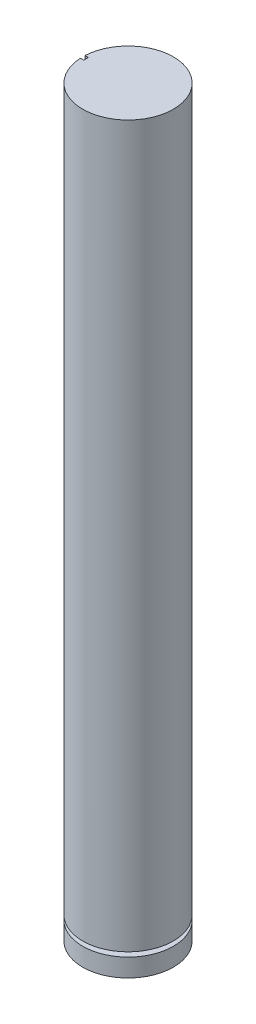
ISO-10303-21;
HEADER;
FILE_DESCRIPTION(('STEP AP214'),'2;1');
FILE_NAME('part.step','',(''),(''),'','','');
FILE_SCHEMA(('AUTOMOTIVE_DESIGN { 1 0 10303 214 1 1 1 1 }'));
ENDSEC;
DATA;
#1=APPLICATION_CONTEXT('core data for automotive mechanical design processes');
#2=APPLICATION_PROTOCOL_DEFINITION('international standard','automotive_design',2000,#1);
#3=PRODUCT_CONTEXT('',#1,'mechanical');
#4=PRODUCT('Part','Part','',(#3));
#5=PRODUCT_RELATED_PRODUCT_CATEGORY('part','',(#4));
#6=PRODUCT_DEFINITION_FORMATION('','',#4);
#7=PRODUCT_DEFINITION_CONTEXT('part definition',#1,'design');
#8=PRODUCT_DEFINITION('design','',#6,#7);
#9=PRODUCT_DEFINITION_SHAPE('','',#8);
#10=(LENGTH_UNIT() NAMED_UNIT(*) SI_UNIT(.MILLI.,.METRE.));
#11=(NAMED_UNIT(*) PLANE_ANGLE_UNIT() SI_UNIT($,.RADIAN.));
#12=(NAMED_UNIT(*) SI_UNIT($,.STERADIAN.) SOLID_ANGLE_UNIT());
#13=UNCERTAINTY_MEASURE_WITH_UNIT(LENGTH_MEASURE(1.E-05),#10,'distance_accuracy_value','');
#14=(GEOMETRIC_REPRESENTATION_CONTEXT(3) GLOBAL_UNCERTAINTY_ASSIGNED_CONTEXT((#13)) GLOBAL_UNIT_ASSIGNED_CONTEXT((#10,
#11,#12)) REPRESENTATION_CONTEXT('',''));
#15=CARTESIAN_POINT('',(0.,0.,0.));
#16=DIRECTION('',(0.,0.,1.));
#17=DIRECTION('',(1.,0.,0.));
#18=AXIS2_PLACEMENT_3D('',#15,#16,#17);
#19=CARTESIAN_POINT('',(0.,32.766,0.));
#20=DIRECTION('',(0.,-1.,0.));
#21=DIRECTION('',(0.,0.,-1.));
#22=AXIS2_PLACEMENT_3D('',#19,#20,#21);
#23=CYLINDRICAL_SURFACE('',#22,2.);
#24=CARTESIAN_POINT('',(0.,0.800000000000001,0.));
#25=DIRECTION('',(0.,-1.,0.));
#26=DIRECTION('',(0.,0.,-1.));
#27=AXIS2_PLACEMENT_3D('',#24,#25,#26);
#28=CIRCLE('',#27,2.);
#29=CARTESIAN_POINT('',(0.,0.800000000000001,-2.));
#30=VERTEX_POINT('',#29);
#31=EDGE_CURVE('E131',#30,#30,#28,.T.);
#32=ORIENTED_EDGE('',*,*,#31,.T.);
#33=EDGE_LOOP('',(#32));
#34=FACE_BOUND('',#33,.T.);
#35=CARTESIAN_POINT('',(0.,0.,0.));
#36=DIRECTION('',(0.,1.,0.));
#37=DIRECTION('',(0.,0.,1.));
#38=AXIS2_PLACEMENT_3D('',#35,#36,#37);
#39=CIRCLE('',#38,2.);
#40=CARTESIAN_POINT('',(0.,0.,2.));
#41=VERTEX_POINT('',#40);
#42=EDGE_CURVE('E135',#41,#41,#39,.T.);
#43=ORIENTED_EDGE('',*,*,#42,.T.);
#44=EDGE_LOOP('',(#43));
#45=FACE_BOUND('',#44,.T.);
#46=ADVANCED_FACE('F43',(#34,#45),#23,.T.);
#47=CARTESIAN_POINT('',(0.,0.,0.));
#48=DIRECTION('',(0.,1.,0.));
#49=DIRECTION('',(0.,0.,1.));
#50=AXIS2_PLACEMENT_3D('',#47,#48,#49);
#51=PLANE('',#50);
#52=ORIENTED_EDGE('',*,*,#42,.F.);
#53=EDGE_LOOP('',(#52));
#54=FACE_BOUND('',#53,.T.);
#55=ADVANCED_FACE('F162',(#54),#51,.F.);
#56=CARTESIAN_POINT('',(0.,0.800000000000001,-2.));
#57=DIRECTION('',(0.,-1.,0.));
#58=DIRECTION('',(0.,0.,-1.));
#59=AXIS2_PLACEMENT_3D('',#56,#57,#58);
#60=PLANE('',#59);
#61=ORIENTED_EDGE('',*,*,#31,.F.);
#62=EDGE_LOOP('',(#61));
#63=FACE_BOUND('',#62,.T.);
#64=CARTESIAN_POINT('',(0.,0.8,0.));
#65=DIRECTION('',(0.,-1.,0.));
#66=DIRECTION('',(0.,0.,-1.));
#67=AXIS2_PLACEMENT_3D('',#64,#65,#66);
#68=CIRCLE('',#67,1.5);
#69=CARTESIAN_POINT('',(0.,0.8,-1.5));
#70=VERTEX_POINT('',#69);
#71=EDGE_CURVE('E127',#70,#70,#68,.T.);
#72=ORIENTED_EDGE('',*,*,#71,.T.);
#73=EDGE_LOOP('',(#72));
#74=FACE_BOUND('',#73,.T.);
#75=ADVANCED_FACE('F167',(#63,#74),#60,.F.);
#76=CARTESIAN_POINT('',(0.,0.,0.));
#77=DIRECTION('',(0.,-1.,0.));
#78=DIRECTION('',(0.,0.,-1.));
#79=AXIS2_PLACEMENT_3D('',#76,#77,#78);
#80=CYLINDRICAL_SURFACE('',#79,1.5);
#81=ORIENTED_EDGE('',*,*,#71,.F.);
#82=EDGE_LOOP('',(#81));
#83=FACE_BOUND('',#82,.T.);
#84=CARTESIAN_POINT('',(0.,1.,0.));
#85=DIRECTION('',(0.,-1.,0.));
#86=DIRECTION('',(0.,0.,-1.));
#87=AXIS2_PLACEMENT_3D('',#84,#85,#86);
#88=CIRCLE('',#87,1.5);
#89=CARTESIAN_POINT('',(0.,1.,-1.5));
#90=VERTEX_POINT('',#89);
#91=EDGE_CURVE('E123',#90,#90,#88,.T.);
#92=ORIENTED_EDGE('',*,*,#91,.T.);
#93=EDGE_LOOP('',(#92));
#94=FACE_BOUND('',#93,.T.);
#95=ADVANCED_FACE('F175',(#83,#94),#80,.T.);
#96=CARTESIAN_POINT('',(0.,1.,-2.));
#97=DIRECTION('',(0.,1.,0.));
#98=DIRECTION('',(0.,0.,1.));
#99=AXIS2_PLACEMENT_3D('',#96,#97,#98);
#100=PLANE('',#99);
#101=ORIENTED_EDGE('',*,*,#91,.F.);
#102=EDGE_LOOP('',(#101));
#103=FACE_BOUND('',#102,.T.);
#104=CARTESIAN_POINT('',(0.,1.,0.));
#105=DIRECTION('',(0.,-1.,0.));
#106=DIRECTION('',(0.,0.,-1.));
#107=AXIS2_PLACEMENT_3D('',#104,#105,#106);
#108=CIRCLE('',#107,2.);
#109=CARTESIAN_POINT('',(0.,1.,-2.));
#110=VERTEX_POINT('',#109);
#111=EDGE_CURVE('E118',#110,#110,#108,.T.);
#112=ORIENTED_EDGE('',*,*,#111,.T.);
#113=EDGE_LOOP('',(#112));
#114=FACE_BOUND('',#113,.T.);
#115=ADVANCED_FACE('F181',(#103,#114),#100,.F.);
#116=CARTESIAN_POINT('',(0.,32.766,0.));
#117=DIRECTION('',(0.,1.,0.));
#118=DIRECTION('',(0.,0.,1.));
#119=AXIS2_PLACEMENT_3D('',#116,#117,#118);
#120=PLANE('',#119);
#121=DIRECTION('',(-1.,0.,0.));
#122=VECTOR('',#121,1.);
#123=CARTESIAN_POINT('',(-2.,32.766,-0.0999999999999998));
#124=LINE('',#123,#122);
#125=CARTESIAN_POINT('',(-1.85,32.766,-0.0999999999999998));
#126=VERTEX_POINT('',#125);
#127=CARTESIAN_POINT('',(-1.99749843554382,32.766,-0.0999999999999998));
#128=VERTEX_POINT('',#127);
#129=EDGE_CURVE('E90',#126,#128,#124,.T.);
#130=ORIENTED_EDGE('',*,*,#129,.F.);
#131=DIRECTION('',(0.,0.,-1.));
#132=VECTOR('',#131,1.);
#133=CARTESIAN_POINT('',(-1.85,32.766,-0.0999999999999998));
#134=LINE('',#133,#132);
#135=CARTESIAN_POINT('',(-1.85,32.766,0.1));
#136=VERTEX_POINT('',#135);
#137=EDGE_CURVE('E112',#136,#126,#134,.T.);
#138=ORIENTED_EDGE('',*,*,#137,.F.);
#139=DIRECTION('',(1.,0.,0.));
#140=VECTOR('',#139,1.);
#141=CARTESIAN_POINT('',(-2.,32.766,0.1));
#142=LINE('',#141,#140);
#143=CARTESIAN_POINT('',(-1.99749843554382,32.766,0.1));
#144=VERTEX_POINT('',#143);
#145=EDGE_CURVE('E96',#144,#136,#142,.T.);
#146=ORIENTED_EDGE('',*,*,#145,.F.);
#147=CARTESIAN_POINT('',(0.,32.766,0.));
#148=DIRECTION('',(0.,1.,0.));
#149=DIRECTION('',(0.,0.,1.));
#150=AXIS2_PLACEMENT_3D('',#147,#148,#149);
#151=CIRCLE('',#150,2.);
#152=EDGE_CURVE('E136',#144,#128,#151,.T.);
#153=ORIENTED_EDGE('',*,*,#152,.T.);
#154=EDGE_LOOP('',(#130,#138,#146,#153));
#155=FACE_BOUND('',#154,.T.);
#156=ADVANCED_FACE('F148',(#155),#120,.T.);
#157=ORIENTED_EDGE('',*,*,#111,.F.);
#158=EDGE_LOOP('',(#157));
#159=FACE_BOUND('',#158,.T.);
#160=CARTESIAN_POINT('',(0.,29.766,0.));
#161=DIRECTION('',(0.,1.,0.));
#162=DIRECTION('',(0.,0.,1.));
#163=AXIS2_PLACEMENT_3D('',#160,#161,#162);
#164=CIRCLE('',#163,2.);
#165=CARTESIAN_POINT('',(-1.99749843554382,29.766,-0.0999999999999998));
#166=VERTEX_POINT('',#165);
#167=CARTESIAN_POINT('',(-1.99749843554382,29.766,0.1));
#168=VERTEX_POINT('',#167);
#169=EDGE_CURVE('E59',#166,#168,#164,.T.);
#170=ORIENTED_EDGE('',*,*,#169,.F.);
#171=DIRECTION('',(0.,-1.,0.));
#172=VECTOR('',#171,1.);
#173=CARTESIAN_POINT('',(-1.99749843554382,32.766,-0.0999999999999998));
#174=LINE('',#173,#172);
#175=EDGE_CURVE('E11',#166,#128,#174,.F.);
#176=ORIENTED_EDGE('',*,*,#175,.T.);
#177=ORIENTED_EDGE('',*,*,#152,.F.);
#178=DIRECTION('',(0.,-1.,0.));
#179=VECTOR('',#178,1.);
#180=CARTESIAN_POINT('',(-1.99749843554382,32.766,0.1));
#181=LINE('',#180,#179);
#182=EDGE_CURVE('E52',#144,#168,#181,.T.);
#183=ORIENTED_EDGE('',*,*,#182,.T.);
#184=EDGE_LOOP('',(#170,#176,#177,#183));
#185=FACE_BOUND('',#184,.T.);
#186=ADVANCED_FACE('F45',(#159,#185),#23,.T.);
#187=CARTESIAN_POINT('',(-2.,29.766,-0.0999999999999998));
#188=DIRECTION('',(0.,0.,-1.));
#189=DIRECTION('',(-1.,0.,0.));
#190=AXIS2_PLACEMENT_3D('',#187,#188,#189);
#191=PLANE('',#190);
#192=DIRECTION('',(-1.,0.,0.));
#193=VECTOR('',#192,1.);
#194=CARTESIAN_POINT('',(-2.,29.766,-0.0999999999999998));
#195=LINE('',#194,#193);
#196=CARTESIAN_POINT('',(-1.85,29.766,-0.0999999999999998));
#197=VERTEX_POINT('',#196);
#198=EDGE_CURVE('E102',#197,#166,#195,.T.);
#199=ORIENTED_EDGE('',*,*,#198,.F.);
#200=DIRECTION('',(0.,1.,0.));
#201=VECTOR('',#200,1.);
#202=CARTESIAN_POINT('',(-1.85,29.766,-0.0999999999999998));
#203=LINE('',#202,#201);
#204=EDGE_CURVE('E101',#197,#126,#203,.T.);
#205=ORIENTED_EDGE('',*,*,#204,.T.);
#206=ORIENTED_EDGE('',*,*,#129,.T.);
#207=ORIENTED_EDGE('',*,*,#175,.F.);
#208=EDGE_LOOP('',(#199,#205,#206,#207));
#209=FACE_BOUND('',#208,.T.);
#210=ADVANCED_FACE('F150',(#209),#191,.F.);
#211=CARTESIAN_POINT('',(-2.,29.766,0.1));
#212=DIRECTION('',(0.,0.,1.));
#213=DIRECTION('',(1.,0.,0.));
#214=AXIS2_PLACEMENT_3D('',#211,#212,#213);
#215=PLANE('',#214);
#216=ORIENTED_EDGE('',*,*,#145,.T.);
#217=DIRECTION('',(0.,1.,0.));
#218=VECTOR('',#217,1.);
#219=CARTESIAN_POINT('',(-1.85,29.766,0.1));
#220=LINE('',#219,#218);
#221=CARTESIAN_POINT('',(-1.85,29.766,0.1));
#222=VERTEX_POINT('',#221);
#223=EDGE_CURVE('E93',#222,#136,#220,.T.);
#224=ORIENTED_EDGE('',*,*,#223,.F.);
#225=DIRECTION('',(1.,0.,0.));
#226=VECTOR('',#225,1.);
#227=CARTESIAN_POINT('',(-2.,29.766,0.1));
#228=LINE('',#227,#226);
#229=EDGE_CURVE('E82',#168,#222,#228,.T.);
#230=ORIENTED_EDGE('',*,*,#229,.F.);
#231=ORIENTED_EDGE('',*,*,#182,.F.);
#232=EDGE_LOOP('',(#216,#224,#230,#231));
#233=FACE_BOUND('',#232,.T.);
#234=ADVANCED_FACE('F94',(#233),#215,.F.);
#235=CARTESIAN_POINT('',(0.,29.766,0.));
#236=DIRECTION('',(0.,1.,0.));
#237=DIRECTION('',(0.,0.,1.));
#238=AXIS2_PLACEMENT_3D('',#235,#236,#237);
#239=PLANE('',#238);
#240=ORIENTED_EDGE('',*,*,#198,.T.);
#241=ORIENTED_EDGE('',*,*,#169,.T.);
#242=ORIENTED_EDGE('',*,*,#229,.T.);
#243=DIRECTION('',(0.,0.,-1.));
#244=VECTOR('',#243,1.);
#245=CARTESIAN_POINT('',(-1.85,29.766,-0.0999999999999998));
#246=LINE('',#245,#244);
#247=EDGE_CURVE('E86',#222,#197,#246,.T.);
#248=ORIENTED_EDGE('',*,*,#247,.T.);
#249=EDGE_LOOP('',(#240,#241,#242,#248));
#250=FACE_BOUND('',#249,.T.);
#251=ADVANCED_FACE('F84',(#250),#239,.T.);
#252=CARTESIAN_POINT('',(-1.85,29.766,-0.0999999999999998));
#253=DIRECTION('',(1.,0.,0.));
#254=DIRECTION('',(0.,0.,-1.));
#255=AXIS2_PLACEMENT_3D('',#252,#253,#254);
#256=PLANE('',#255);
#257=ORIENTED_EDGE('',*,*,#137,.T.);
#258=ORIENTED_EDGE('',*,*,#204,.F.);
#259=ORIENTED_EDGE('',*,*,#247,.F.);
#260=ORIENTED_EDGE('',*,*,#223,.T.);
#261=EDGE_LOOP('',(#257,#258,#259,#260));
#262=FACE_BOUND('',#261,.T.);
#263=ADVANCED_FACE('F104',(#262),#256,.F.);
#264=CLOSED_SHELL('',(#46,#55,#75,#95,#115,#156,#186,#210,#234,#251,#263));
#265=MANIFOLD_SOLID_BREP('B2',#264);
#266=ADVANCED_BREP_SHAPE_REPRESENTATION('',(#18,#265),#14);
#267=SHAPE_DEFINITION_REPRESENTATION(#9,#266);
ENDSEC;
END-ISO-10303-21;
